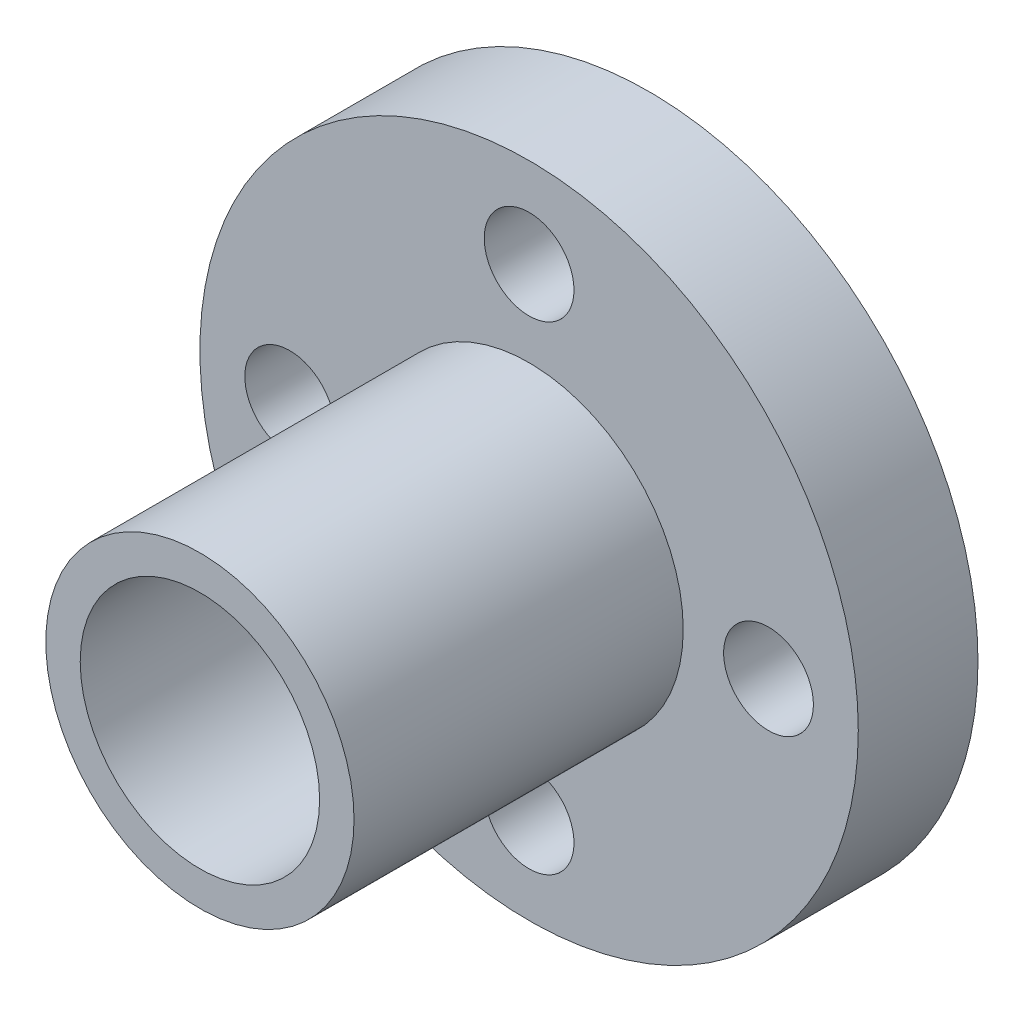
ISO-10303-21;
HEADER;
FILE_DESCRIPTION(('STEP AP214'),'2;1');
FILE_NAME('part.step','',(''),(''),'','','');
FILE_SCHEMA(('AUTOMOTIVE_DESIGN { 1 0 10303 214 1 1 1 1 }'));
ENDSEC;
DATA;
#1=APPLICATION_CONTEXT('core data for automotive mechanical design processes');
#2=APPLICATION_PROTOCOL_DEFINITION('international standard','automotive_design',2000,#1);
#3=PRODUCT_CONTEXT('',#1,'mechanical');
#4=PRODUCT('Part','Part','',(#3));
#5=PRODUCT_RELATED_PRODUCT_CATEGORY('part','',(#4));
#6=PRODUCT_DEFINITION_FORMATION('','',#4);
#7=PRODUCT_DEFINITION_CONTEXT('part definition',#1,'design');
#8=PRODUCT_DEFINITION('design','',#6,#7);
#9=PRODUCT_DEFINITION_SHAPE('','',#8);
#10=(LENGTH_UNIT() NAMED_UNIT(*) SI_UNIT(.MILLI.,.METRE.));
#11=(NAMED_UNIT(*) PLANE_ANGLE_UNIT() SI_UNIT($,.RADIAN.));
#12=(NAMED_UNIT(*) SI_UNIT($,.STERADIAN.) SOLID_ANGLE_UNIT());
#13=UNCERTAINTY_MEASURE_WITH_UNIT(LENGTH_MEASURE(1.E-05),#10,'distance_accuracy_value','');
#14=(GEOMETRIC_REPRESENTATION_CONTEXT(3) GLOBAL_UNCERTAINTY_ASSIGNED_CONTEXT((#13)) GLOBAL_UNIT_ASSIGNED_CONTEXT((#10,
#11,#12)) REPRESENTATION_CONTEXT('',''));
#15=CARTESIAN_POINT('',(0.,0.,0.));
#16=DIRECTION('',(0.,0.,1.));
#17=DIRECTION('',(1.,0.,0.));
#18=AXIS2_PLACEMENT_3D('',#15,#16,#17);
#19=CARTESIAN_POINT('',(0.,0.,4.));
#20=DIRECTION('',(0.,0.,-1.));
#21=DIRECTION('',(-1.,0.,0.));
#22=AXIS2_PLACEMENT_3D('',#19,#20,#21);
#23=CYLINDRICAL_SURFACE('',#22,11.);
#24=CARTESIAN_POINT('',(0.,0.,4.));
#25=DIRECTION('',(0.,0.,1.));
#26=DIRECTION('',(1.,0.,0.));
#27=AXIS2_PLACEMENT_3D('',#24,#25,#26);
#28=CIRCLE('',#27,11.);
#29=CARTESIAN_POINT('',(11.,0.,4.));
#30=VERTEX_POINT('',#29);
#31=EDGE_CURVE('E44',#30,#30,#28,.T.);
#32=ORIENTED_EDGE('',*,*,#31,.F.);
#33=EDGE_LOOP('',(#32));
#34=FACE_BOUND('',#33,.T.);
#35=CARTESIAN_POINT('',(0.,0.,0.));
#36=DIRECTION('',(0.,0.,1.));
#37=DIRECTION('',(1.,0.,0.));
#38=AXIS2_PLACEMENT_3D('',#35,#36,#37);
#39=CIRCLE('',#38,11.);
#40=CARTESIAN_POINT('',(11.,0.,0.));
#41=VERTEX_POINT('',#40);
#42=EDGE_CURVE('E40',#41,#41,#39,.T.);
#43=ORIENTED_EDGE('',*,*,#42,.T.);
#44=EDGE_LOOP('',(#43));
#45=FACE_BOUND('',#44,.T.);
#46=ADVANCED_FACE('F37',(#34,#45),#23,.T.);
#47=CARTESIAN_POINT('',(0.,0.,4.));
#48=DIRECTION('',(0.,0.,1.));
#49=DIRECTION('',(1.,0.,0.));
#50=AXIS2_PLACEMENT_3D('',#47,#48,#49);
#51=PLANE('',#50);
#52=CARTESIAN_POINT('',(0.,8.,4.));
#53=DIRECTION('',(0.,0.,1.));
#54=DIRECTION('',(1.,0.,0.));
#55=AXIS2_PLACEMENT_3D('',#52,#53,#54);
#56=CIRCLE('',#55,1.5);
#57=CARTESIAN_POINT('',(1.5,8.,4.));
#58=VERTEX_POINT('',#57);
#59=EDGE_CURVE('E78',#58,#58,#56,.T.);
#60=ORIENTED_EDGE('',*,*,#59,.F.);
#61=EDGE_LOOP('',(#60));
#62=FACE_BOUND('',#61,.T.);
#63=CARTESIAN_POINT('',(8.,0.,4.));
#64=DIRECTION('',(0.,0.,1.));
#65=DIRECTION('',(1.,0.,0.));
#66=AXIS2_PLACEMENT_3D('',#63,#64,#65);
#67=CIRCLE('',#66,1.5);
#68=CARTESIAN_POINT('',(9.5,0.,4.));
#69=VERTEX_POINT('',#68);
#70=EDGE_CURVE('E72',#69,#69,#67,.T.);
#71=ORIENTED_EDGE('',*,*,#70,.F.);
#72=EDGE_LOOP('',(#71));
#73=FACE_BOUND('',#72,.T.);
#74=CARTESIAN_POINT('',(0.,-8.,4.));
#75=DIRECTION('',(0.,0.,1.));
#76=DIRECTION('',(1.,0.,0.));
#77=AXIS2_PLACEMENT_3D('',#74,#75,#76);
#78=CIRCLE('',#77,1.5);
#79=CARTESIAN_POINT('',(1.49999999999994,-8.,4.));
#80=VERTEX_POINT('',#79);
#81=EDGE_CURVE('E66',#80,#80,#78,.T.);
#82=ORIENTED_EDGE('',*,*,#81,.F.);
#83=EDGE_LOOP('',(#82));
#84=FACE_BOUND('',#83,.T.);
#85=CARTESIAN_POINT('',(-8.,0.,4.));
#86=DIRECTION('',(0.,0.,1.));
#87=DIRECTION('',(1.,0.,0.));
#88=AXIS2_PLACEMENT_3D('',#85,#86,#87);
#89=CIRCLE('',#88,1.5);
#90=CARTESIAN_POINT('',(-6.5,0.,4.));
#91=VERTEX_POINT('',#90);
#92=EDGE_CURVE('E60',#91,#91,#89,.T.);
#93=ORIENTED_EDGE('',*,*,#92,.F.);
#94=EDGE_LOOP('',(#93));
#95=FACE_BOUND('',#94,.T.);
#96=CARTESIAN_POINT('',(0.,0.,4.));
#97=DIRECTION('',(0.,0.,1.));
#98=DIRECTION('',(1.,0.,0.));
#99=AXIS2_PLACEMENT_3D('',#96,#97,#98);
#100=CIRCLE('',#99,5.15);
#101=CARTESIAN_POINT('',(5.15,0.,4.));
#102=VERTEX_POINT('',#101);
#103=EDGE_CURVE('E10',#102,#102,#100,.T.);
#104=ORIENTED_EDGE('',*,*,#103,.F.);
#105=EDGE_LOOP('',(#104));
#106=FACE_BOUND('',#105,.T.);
#107=ORIENTED_EDGE('',*,*,#31,.T.);
#108=EDGE_LOOP('',(#107));
#109=FACE_BOUND('',#108,.T.);
#110=ADVANCED_FACE('F94',(#62,#73,#84,#95,#106,#109),#51,.T.);
#111=CARTESIAN_POINT('',(0.,0.,0.));
#112=DIRECTION('',(0.,0.,1.));
#113=DIRECTION('',(1.,0.,0.));
#114=AXIS2_PLACEMENT_3D('',#111,#112,#113);
#115=PLANE('',#114);
#116=CARTESIAN_POINT('',(0.,8.,0.));
#117=DIRECTION('',(0.,0.,1.));
#118=DIRECTION('',(1.,0.,0.));
#119=AXIS2_PLACEMENT_3D('',#116,#117,#118);
#120=CIRCLE('',#119,1.5);
#121=CARTESIAN_POINT('',(1.5,8.,0.));
#122=VERTEX_POINT('',#121);
#123=EDGE_CURVE('E57',#122,#122,#120,.T.);
#124=ORIENTED_EDGE('',*,*,#123,.T.);
#125=EDGE_LOOP('',(#124));
#126=FACE_BOUND('',#125,.T.);
#127=CARTESIAN_POINT('',(8.,0.,0.));
#128=DIRECTION('',(0.,0.,1.));
#129=DIRECTION('',(1.,0.,0.));
#130=AXIS2_PLACEMENT_3D('',#127,#128,#129);
#131=CIRCLE('',#130,1.5);
#132=CARTESIAN_POINT('',(9.5,0.,0.));
#133=VERTEX_POINT('',#132);
#134=EDGE_CURVE('E75',#133,#133,#131,.T.);
#135=ORIENTED_EDGE('',*,*,#134,.T.);
#136=EDGE_LOOP('',(#135));
#137=FACE_BOUND('',#136,.T.);
#138=CARTESIAN_POINT('',(0.,-8.,0.));
#139=DIRECTION('',(0.,0.,1.));
#140=DIRECTION('',(1.,0.,0.));
#141=AXIS2_PLACEMENT_3D('',#138,#139,#140);
#142=CIRCLE('',#141,1.5);
#143=CARTESIAN_POINT('',(1.49999999999994,-8.,0.));
#144=VERTEX_POINT('',#143);
#145=EDGE_CURVE('E69',#144,#144,#142,.T.);
#146=ORIENTED_EDGE('',*,*,#145,.T.);
#147=EDGE_LOOP('',(#146));
#148=FACE_BOUND('',#147,.T.);
#149=CARTESIAN_POINT('',(-8.,0.,0.));
#150=DIRECTION('',(0.,0.,1.));
#151=DIRECTION('',(1.,0.,0.));
#152=AXIS2_PLACEMENT_3D('',#149,#150,#151);
#153=CIRCLE('',#152,1.5);
#154=CARTESIAN_POINT('',(-6.5,0.,0.));
#155=VERTEX_POINT('',#154);
#156=EDGE_CURVE('E63',#155,#155,#153,.T.);
#157=ORIENTED_EDGE('',*,*,#156,.T.);
#158=EDGE_LOOP('',(#157));
#159=FACE_BOUND('',#158,.T.);
#160=CARTESIAN_POINT('',(0.,0.,0.));
#161=DIRECTION('',(0.,0.,1.));
#162=DIRECTION('',(1.,0.,0.));
#163=AXIS2_PLACEMENT_3D('',#160,#161,#162);
#164=CIRCLE('',#163,4.);
#165=CARTESIAN_POINT('',(4.,0.,0.));
#166=VERTEX_POINT('',#165);
#167=EDGE_CURVE('E53',#166,#166,#164,.T.);
#168=ORIENTED_EDGE('',*,*,#167,.T.);
#169=EDGE_LOOP('',(#168));
#170=FACE_BOUND('',#169,.T.);
#171=ORIENTED_EDGE('',*,*,#42,.F.);
#172=EDGE_LOOP('',(#171));
#173=FACE_BOUND('',#172,.T.);
#174=ADVANCED_FACE('F84',(#126,#137,#148,#159,#170,#173),#115,.F.);
#175=CARTESIAN_POINT('',(0.,0.,15.));
#176=DIRECTION('',(0.,0.,-1.));
#177=DIRECTION('',(-1.,0.,0.));
#178=AXIS2_PLACEMENT_3D('',#175,#176,#177);
#179=CYLINDRICAL_SURFACE('',#178,5.15);
#180=CARTESIAN_POINT('',(0.,0.,15.));
#181=DIRECTION('',(0.,0.,1.));
#182=DIRECTION('',(1.,0.,0.));
#183=AXIS2_PLACEMENT_3D('',#180,#181,#182);
#184=CIRCLE('',#183,5.15);
#185=CARTESIAN_POINT('',(5.15,0.,15.));
#186=VERTEX_POINT('',#185);
#187=EDGE_CURVE('E50',#186,#186,#184,.T.);
#188=ORIENTED_EDGE('',*,*,#187,.F.);
#189=EDGE_LOOP('',(#188));
#190=FACE_BOUND('',#189,.T.);
#191=ORIENTED_EDGE('',*,*,#103,.T.);
#192=EDGE_LOOP('',(#191));
#193=FACE_BOUND('',#192,.T.);
#194=ADVANCED_FACE('F113',(#190,#193),#179,.T.);
#195=CARTESIAN_POINT('',(0.,0.,15.));
#196=DIRECTION('',(0.,0.,1.));
#197=DIRECTION('',(1.,0.,0.));
#198=AXIS2_PLACEMENT_3D('',#195,#196,#197);
#199=PLANE('',#198);
#200=CARTESIAN_POINT('',(0.,0.,15.));
#201=DIRECTION('',(0.,0.,1.));
#202=DIRECTION('',(1.,0.,0.));
#203=AXIS2_PLACEMENT_3D('',#200,#201,#202);
#204=CIRCLE('',#203,4.);
#205=CARTESIAN_POINT('',(4.,0.,15.));
#206=VERTEX_POINT('',#205);
#207=EDGE_CURVE('E54',#206,#206,#204,.T.);
#208=ORIENTED_EDGE('',*,*,#207,.F.);
#209=EDGE_LOOP('',(#208));
#210=FACE_BOUND('',#209,.T.);
#211=ORIENTED_EDGE('',*,*,#187,.T.);
#212=EDGE_LOOP('',(#211));
#213=FACE_BOUND('',#212,.T.);
#214=ADVANCED_FACE('F117',(#210,#213),#199,.T.);
#215=CARTESIAN_POINT('',(0.,0.,0.));
#216=DIRECTION('',(0.,0.,1.));
#217=DIRECTION('',(1.,0.,0.));
#218=AXIS2_PLACEMENT_3D('',#215,#216,#217);
#219=CYLINDRICAL_SURFACE('',#218,4.);
#220=ORIENTED_EDGE('',*,*,#167,.F.);
#221=EDGE_LOOP('',(#220));
#222=FACE_BOUND('',#221,.T.);
#223=ORIENTED_EDGE('',*,*,#207,.T.);
#224=EDGE_LOOP('',(#223));
#225=FACE_BOUND('',#224,.T.);
#226=ADVANCED_FACE('F123',(#222,#225),#219,.F.);
#227=CARTESIAN_POINT('',(-8.,0.,0.));
#228=DIRECTION('',(0.,0.,1.));
#229=DIRECTION('',(1.,0.,0.));
#230=AXIS2_PLACEMENT_3D('',#227,#228,#229);
#231=CYLINDRICAL_SURFACE('',#230,1.5);
#232=ORIENTED_EDGE('',*,*,#156,.F.);
#233=EDGE_LOOP('',(#232));
#234=FACE_BOUND('',#233,.T.);
#235=ORIENTED_EDGE('',*,*,#92,.T.);
#236=EDGE_LOOP('',(#235));
#237=FACE_BOUND('',#236,.T.);
#238=ADVANCED_FACE('F127',(#234,#237),#231,.F.);
#239=CARTESIAN_POINT('',(0.,-8.,0.));
#240=DIRECTION('',(0.,0.,1.));
#241=DIRECTION('',(1.,0.,0.));
#242=AXIS2_PLACEMENT_3D('',#239,#240,#241);
#243=CYLINDRICAL_SURFACE('',#242,1.5);
#244=ORIENTED_EDGE('',*,*,#145,.F.);
#245=EDGE_LOOP('',(#244));
#246=FACE_BOUND('',#245,.T.);
#247=ORIENTED_EDGE('',*,*,#81,.T.);
#248=EDGE_LOOP('',(#247));
#249=FACE_BOUND('',#248,.T.);
#250=ADVANCED_FACE('F131',(#246,#249),#243,.F.);
#251=CARTESIAN_POINT('',(8.,0.,0.));
#252=DIRECTION('',(0.,0.,1.));
#253=DIRECTION('',(1.,0.,0.));
#254=AXIS2_PLACEMENT_3D('',#251,#252,#253);
#255=CYLINDRICAL_SURFACE('',#254,1.5);
#256=ORIENTED_EDGE('',*,*,#134,.F.);
#257=EDGE_LOOP('',(#256));
#258=FACE_BOUND('',#257,.T.);
#259=ORIENTED_EDGE('',*,*,#70,.T.);
#260=EDGE_LOOP('',(#259));
#261=FACE_BOUND('',#260,.T.);
#262=ADVANCED_FACE('F90',(#258,#261),#255,.F.);
#263=CARTESIAN_POINT('',(0.,8.,0.));
#264=DIRECTION('',(0.,0.,1.));
#265=DIRECTION('',(1.,0.,0.));
#266=AXIS2_PLACEMENT_3D('',#263,#264,#265);
#267=CYLINDRICAL_SURFACE('',#266,1.5);
#268=ORIENTED_EDGE('',*,*,#123,.F.);
#269=EDGE_LOOP('',(#268));
#270=FACE_BOUND('',#269,.T.);
#271=ORIENTED_EDGE('',*,*,#59,.T.);
#272=EDGE_LOOP('',(#271));
#273=FACE_BOUND('',#272,.T.);
#274=ADVANCED_FACE('F87',(#270,#273),#267,.F.);
#275=CLOSED_SHELL('',(#46,#110,#174,#194,#214,#226,#238,#250,#262,#274));
#276=MANIFOLD_SOLID_BREP('B2',#275);
#277=ADVANCED_BREP_SHAPE_REPRESENTATION('',(#18,#276),#14);
#278=SHAPE_DEFINITION_REPRESENTATION(#9,#277);
ENDSEC;
END-ISO-10303-21;
